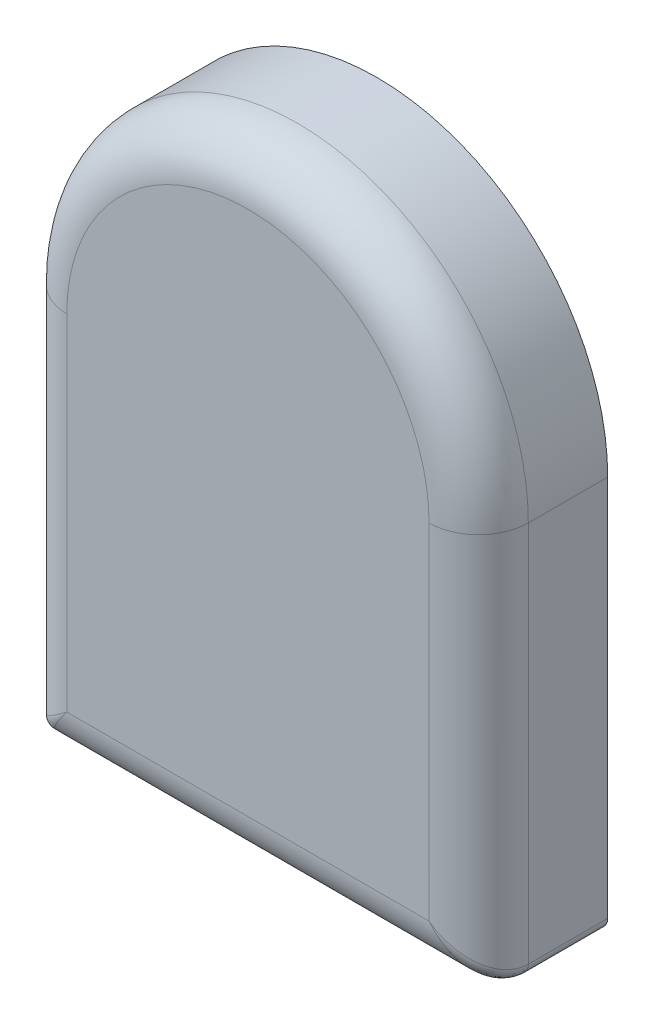
ISO-10303-21;
HEADER;
FILE_DESCRIPTION(('STEP AP214'),'2;1');
FILE_NAME('part.step','',(''),(''),'','','');
FILE_SCHEMA(('AUTOMOTIVE_DESIGN { 1 0 10303 214 1 1 1 1 }'));
ENDSEC;
DATA;
#1=APPLICATION_CONTEXT('core data for automotive mechanical design processes');
#2=APPLICATION_PROTOCOL_DEFINITION('international standard','automotive_design',2000,#1);
#3=PRODUCT_CONTEXT('',#1,'mechanical');
#4=PRODUCT('Part','Part','',(#3));
#5=PRODUCT_RELATED_PRODUCT_CATEGORY('part','',(#4));
#6=PRODUCT_DEFINITION_FORMATION('','',#4);
#7=PRODUCT_DEFINITION_CONTEXT('part definition',#1,'design');
#8=PRODUCT_DEFINITION('design','',#6,#7);
#9=PRODUCT_DEFINITION_SHAPE('','',#8);
#10=(LENGTH_UNIT() NAMED_UNIT(*) SI_UNIT(.MILLI.,.METRE.));
#11=(NAMED_UNIT(*) PLANE_ANGLE_UNIT() SI_UNIT($,.RADIAN.));
#12=(NAMED_UNIT(*) SI_UNIT($,.STERADIAN.) SOLID_ANGLE_UNIT());
#13=UNCERTAINTY_MEASURE_WITH_UNIT(LENGTH_MEASURE(1.E-05),#10,'distance_accuracy_value','');
#14=(GEOMETRIC_REPRESENTATION_CONTEXT(3) GLOBAL_UNCERTAINTY_ASSIGNED_CONTEXT((#13)) GLOBAL_UNIT_ASSIGNED_CONTEXT((#10,
#11,#12)) REPRESENTATION_CONTEXT('',''));
#15=CARTESIAN_POINT('',(0.,0.,0.));
#16=DIRECTION('',(0.,0.,1.));
#17=DIRECTION('',(1.,0.,0.));
#18=AXIS2_PLACEMENT_3D('',#15,#16,#17);
#19=CARTESIAN_POINT('',(8.8,-12.1,5.2));
#20=DIRECTION('',(0.,0.,-1.));
#21=DIRECTION('',(-1.,0.,0.));
#22=AXIS2_PLACEMENT_3D('',#19,#20,#21);
#23=CYLINDRICAL_SURFACE('',#22,0.5);
#24=DIRECTION('',(0.,0.,-1.));
#25=VECTOR('',#24,1.);
#26=CARTESIAN_POINT('',(9.3,-12.1,5.2));
#27=LINE('',#26,#25);
#28=CARTESIAN_POINT('',(9.3,-12.1,3.2));
#29=VERTEX_POINT('',#28);
#30=CARTESIAN_POINT('',(9.3,-12.1,0.));
#31=VERTEX_POINT('',#30);
#32=EDGE_CURVE('E103',#29,#31,#27,.T.);
#33=ORIENTED_EDGE('',*,*,#32,.F.);
#34=CARTESIAN_POINT('',(8.8,-12.1,3.2));
#35=DIRECTION('',(0.,0.,-1.));
#36=DIRECTION('',(-1.,0.,0.));
#37=AXIS2_PLACEMENT_3D('',#34,#35,#36);
#38=CIRCLE('',#37,0.5);
#39=CARTESIAN_POINT('',(8.8,-12.6,3.2));
#40=VERTEX_POINT('',#39);
#41=EDGE_CURVE('E161',#29,#40,#38,.T.);
#42=ORIENTED_EDGE('',*,*,#41,.T.);
#43=DIRECTION('',(0.,0.,-1.));
#44=VECTOR('',#43,1.);
#45=CARTESIAN_POINT('',(8.8,-12.6,5.2));
#46=LINE('',#45,#44);
#47=CARTESIAN_POINT('',(8.8,-12.6,0.));
#48=VERTEX_POINT('',#47);
#49=EDGE_CURVE('E127',#40,#48,#46,.T.);
#50=ORIENTED_EDGE('',*,*,#49,.T.);
#51=CARTESIAN_POINT('',(8.8,-12.1,0.));
#52=DIRECTION('',(0.,0.,1.));
#53=DIRECTION('',(1.,0.,0.));
#54=AXIS2_PLACEMENT_3D('',#51,#52,#53);
#55=CIRCLE('',#54,0.5);
#56=EDGE_CURVE('E121',#48,#31,#55,.T.);
#57=ORIENTED_EDGE('',*,*,#56,.T.);
#58=EDGE_LOOP('',(#33,#42,#50,#57));
#59=FACE_BOUND('',#58,.T.);
#60=ADVANCED_FACE('F38',(#59),#23,.T.);
#61=CARTESIAN_POINT('',(9.3,3.3,5.2));
#62=DIRECTION('',(-1.,0.,0.));
#63=DIRECTION('',(0.,0.,1.));
#64=AXIS2_PLACEMENT_3D('',#61,#62,#63);
#65=PLANE('',#64);
#66=DIRECTION('',(0.,0.,-1.));
#67=VECTOR('',#66,1.);
#68=CARTESIAN_POINT('',(9.3,3.3,5.2));
#69=LINE('',#68,#67);
#70=CARTESIAN_POINT('',(9.3,3.3,3.2));
#71=VERTEX_POINT('',#70);
#72=CARTESIAN_POINT('',(9.3,3.3,0.));
#73=VERTEX_POINT('',#72);
#74=EDGE_CURVE('E115',#71,#73,#69,.T.);
#75=ORIENTED_EDGE('',*,*,#74,.F.);
#76=DIRECTION('',(0.,1.,0.));
#77=VECTOR('',#76,1.);
#78=CARTESIAN_POINT('',(9.3,-12.1,3.2));
#79=LINE('',#78,#77);
#80=EDGE_CURVE('E110',#71,#29,#79,.F.);
#81=ORIENTED_EDGE('',*,*,#80,.T.);
#82=ORIENTED_EDGE('',*,*,#32,.T.);
#83=DIRECTION('',(0.,1.,0.));
#84=VECTOR('',#83,1.);
#85=CARTESIAN_POINT('',(9.3,3.3,0.));
#86=LINE('',#85,#84);
#87=EDGE_CURVE('E107',#31,#73,#86,.T.);
#88=ORIENTED_EDGE('',*,*,#87,.T.);
#89=EDGE_LOOP('',(#75,#81,#82,#88));
#90=FACE_BOUND('',#89,.T.);
#91=ADVANCED_FACE('F106',(#90),#65,.F.);
#92=CARTESIAN_POINT('',(0.,3.3,5.2));
#93=DIRECTION('',(0.,0.,-1.));
#94=DIRECTION('',(-1.,0.,0.));
#95=AXIS2_PLACEMENT_3D('',#92,#93,#94);
#96=CYLINDRICAL_SURFACE('',#95,9.3);
#97=DIRECTION('',(0.,0.,-1.));
#98=VECTOR('',#97,1.);
#99=CARTESIAN_POINT('',(-9.3,3.3,5.2));
#100=LINE('',#99,#98);
#101=CARTESIAN_POINT('',(-9.3,3.3,3.2));
#102=VERTEX_POINT('',#101);
#103=CARTESIAN_POINT('',(-9.3,3.3,0.));
#104=VERTEX_POINT('',#103);
#105=EDGE_CURVE('E147',#102,#104,#100,.T.);
#106=ORIENTED_EDGE('',*,*,#105,.F.);
#107=CARTESIAN_POINT('',(0.,3.3,3.2));
#108=DIRECTION('',(0.,0.,1.));
#109=DIRECTION('',(1.,0.,0.));
#110=AXIS2_PLACEMENT_3D('',#107,#108,#109);
#111=CIRCLE('',#110,9.3);
#112=EDGE_CURVE('E164',#102,#71,#111,.F.);
#113=ORIENTED_EDGE('',*,*,#112,.T.);
#114=ORIENTED_EDGE('',*,*,#74,.T.);
#115=CARTESIAN_POINT('',(0.,3.3,0.));
#116=DIRECTION('',(0.,0.,1.));
#117=DIRECTION('',(1.,0.,0.));
#118=AXIS2_PLACEMENT_3D('',#115,#116,#117);
#119=CIRCLE('',#118,9.3);
#120=EDGE_CURVE('E124',#73,#104,#119,.T.);
#121=ORIENTED_EDGE('',*,*,#120,.T.);
#122=EDGE_LOOP('',(#106,#113,#114,#121));
#123=FACE_BOUND('',#122,.T.);
#124=ADVANCED_FACE('F216',(#123),#96,.T.);
#125=CARTESIAN_POINT('',(-9.3,-12.1,5.2));
#126=DIRECTION('',(1.,0.,0.));
#127=DIRECTION('',(0.,1.,0.));
#128=AXIS2_PLACEMENT_3D('',#125,#126,#127);
#129=PLANE('',#128);
#130=DIRECTION('',(0.,0.,-1.));
#131=VECTOR('',#130,1.);
#132=CARTESIAN_POINT('',(-9.3,-12.1,5.2));
#133=LINE('',#132,#131);
#134=CARTESIAN_POINT('',(-9.3,-12.1,3.2));
#135=VERTEX_POINT('',#134);
#136=CARTESIAN_POINT('',(-9.3,-12.1,0.));
#137=VERTEX_POINT('',#136);
#138=EDGE_CURVE('E145',#135,#137,#133,.T.);
#139=ORIENTED_EDGE('',*,*,#138,.F.);
#140=DIRECTION('',(0.,-1.,0.));
#141=VECTOR('',#140,1.);
#142=CARTESIAN_POINT('',(-9.3,3.3,3.2));
#143=LINE('',#142,#141);
#144=EDGE_CURVE('E47',#135,#102,#143,.F.);
#145=ORIENTED_EDGE('',*,*,#144,.T.);
#146=ORIENTED_EDGE('',*,*,#105,.T.);
#147=DIRECTION('',(0.,-1.,0.));
#148=VECTOR('',#147,1.);
#149=CARTESIAN_POINT('',(-9.3,-12.1,0.));
#150=LINE('',#149,#148);
#151=EDGE_CURVE('E134',#104,#137,#150,.T.);
#152=ORIENTED_EDGE('',*,*,#151,.T.);
#153=EDGE_LOOP('',(#139,#145,#146,#152));
#154=FACE_BOUND('',#153,.T.);
#155=ADVANCED_FACE('F217',(#154),#129,.F.);
#156=CARTESIAN_POINT('',(-8.8,-12.1,5.2));
#157=DIRECTION('',(0.,0.,-1.));
#158=DIRECTION('',(-1.,0.,0.));
#159=AXIS2_PLACEMENT_3D('',#156,#157,#158);
#160=CYLINDRICAL_SURFACE('',#159,0.5);
#161=DIRECTION('',(0.,0.,-1.));
#162=VECTOR('',#161,1.);
#163=CARTESIAN_POINT('',(-8.8,-12.6,5.2));
#164=LINE('',#163,#162);
#165=CARTESIAN_POINT('',(-8.8,-12.6,3.2));
#166=VERTEX_POINT('',#165);
#167=CARTESIAN_POINT('',(-8.8,-12.6,0.));
#168=VERTEX_POINT('',#167);
#169=EDGE_CURVE('E143',#166,#168,#164,.T.);
#170=ORIENTED_EDGE('',*,*,#169,.F.);
#171=CARTESIAN_POINT('',(-8.8,-12.1,3.2));
#172=DIRECTION('',(0.,0.,-1.));
#173=DIRECTION('',(-1.,0.,0.));
#174=AXIS2_PLACEMENT_3D('',#171,#172,#173);
#175=CIRCLE('',#174,0.5);
#176=EDGE_CURVE('E11',#166,#135,#175,.T.);
#177=ORIENTED_EDGE('',*,*,#176,.T.);
#178=ORIENTED_EDGE('',*,*,#138,.T.);
#179=CARTESIAN_POINT('',(-8.8,-12.1,0.));
#180=DIRECTION('',(0.,0.,1.));
#181=DIRECTION('',(1.,0.,0.));
#182=AXIS2_PLACEMENT_3D('',#179,#180,#181);
#183=CIRCLE('',#182,0.5);
#184=EDGE_CURVE('E137',#137,#168,#183,.T.);
#185=ORIENTED_EDGE('',*,*,#184,.T.);
#186=EDGE_LOOP('',(#170,#177,#178,#185));
#187=FACE_BOUND('',#186,.T.);
#188=ADVANCED_FACE('F219',(#187),#160,.T.);
#189=CARTESIAN_POINT('',(8.8,-12.6,5.2));
#190=DIRECTION('',(0.,1.,0.));
#191=DIRECTION('',(0.,0.,1.));
#192=AXIS2_PLACEMENT_3D('',#189,#190,#191);
#193=PLANE('',#192);
#194=ORIENTED_EDGE('',*,*,#49,.F.);
#195=DIRECTION('',(1.,0.,0.));
#196=VECTOR('',#195,1.);
#197=CARTESIAN_POINT('',(-8.8,-12.6,3.2));
#198=LINE('',#197,#196);
#199=EDGE_CURVE('E158',#40,#166,#198,.F.);
#200=ORIENTED_EDGE('',*,*,#199,.T.);
#201=ORIENTED_EDGE('',*,*,#169,.T.);
#202=DIRECTION('',(1.,0.,0.));
#203=VECTOR('',#202,1.);
#204=CARTESIAN_POINT('',(8.8,-12.6,0.));
#205=LINE('',#204,#203);
#206=EDGE_CURVE('E140',#168,#48,#205,.T.);
#207=ORIENTED_EDGE('',*,*,#206,.T.);
#208=EDGE_LOOP('',(#194,#200,#201,#207));
#209=FACE_BOUND('',#208,.T.);
#210=ADVANCED_FACE('F221',(#209),#193,.F.);
#211=CARTESIAN_POINT('',(8.8,-12.1,5.2));
#212=DIRECTION('',(0.,0.,1.));
#213=DIRECTION('',(1.,0.,0.));
#214=AXIS2_PLACEMENT_3D('',#211,#212,#213);
#215=PLANE('',#214);
#216=DIRECTION('',(0.,-1.,0.));
#217=VECTOR('',#216,1.);
#218=CARTESIAN_POINT('',(-7.3,-12.1,5.2));
#219=LINE('',#218,#217);
#220=CARTESIAN_POINT('',(-7.3,3.3,5.2));
#221=VERTEX_POINT('',#220);
#222=CARTESIAN_POINT('',(-7.3,-10.6,5.2));
#223=VERTEX_POINT('',#222);
#224=EDGE_CURVE('E114',#221,#223,#219,.T.);
#225=ORIENTED_EDGE('',*,*,#224,.T.);
#226=DIRECTION('',(1.,0.,0.));
#227=VECTOR('',#226,1.);
#228=CARTESIAN_POINT('',(8.8,-10.6,5.2));
#229=LINE('',#228,#227);
#230=CARTESIAN_POINT('',(7.3,-10.6,5.2));
#231=VERTEX_POINT('',#230);
#232=EDGE_CURVE('E155',#223,#231,#229,.T.);
#233=ORIENTED_EDGE('',*,*,#232,.T.);
#234=DIRECTION('',(0.,1.,0.));
#235=VECTOR('',#234,1.);
#236=CARTESIAN_POINT('',(7.3,3.3,5.2));
#237=LINE('',#236,#235);
#238=CARTESIAN_POINT('',(7.3,3.3,5.2));
#239=VERTEX_POINT('',#238);
#240=EDGE_CURVE('E153',#231,#239,#237,.T.);
#241=ORIENTED_EDGE('',*,*,#240,.T.);
#242=CARTESIAN_POINT('',(0.,3.3,5.2));
#243=DIRECTION('',(0.,0.,1.));
#244=DIRECTION('',(1.,0.,0.));
#245=AXIS2_PLACEMENT_3D('',#242,#243,#244);
#246=CIRCLE('',#245,7.3);
#247=EDGE_CURVE('E151',#239,#221,#246,.T.);
#248=ORIENTED_EDGE('',*,*,#247,.T.);
#249=EDGE_LOOP('',(#225,#233,#241,#248));
#250=FACE_BOUND('',#249,.T.);
#251=ADVANCED_FACE('F227',(#250),#215,.T.);
#252=CARTESIAN_POINT('',(8.8,-12.1,0.));
#253=DIRECTION('',(0.,0.,1.));
#254=DIRECTION('',(1.,0.,0.));
#255=AXIS2_PLACEMENT_3D('',#252,#253,#254);
#256=PLANE('',#255);
#257=ORIENTED_EDGE('',*,*,#56,.F.);
#258=ORIENTED_EDGE('',*,*,#206,.F.);
#259=ORIENTED_EDGE('',*,*,#184,.F.);
#260=ORIENTED_EDGE('',*,*,#151,.F.);
#261=ORIENTED_EDGE('',*,*,#120,.F.);
#262=ORIENTED_EDGE('',*,*,#87,.F.);
#263=EDGE_LOOP('',(#257,#258,#259,#260,#261,#262));
#264=FACE_BOUND('',#263,.T.);
#265=ADVANCED_FACE('F119',(#264),#256,.F.);
#266=CARTESIAN_POINT('',(0.,3.3,3.2));
#267=DIRECTION('',(0.,0.,1.));
#268=DIRECTION('',(1.,0.,0.));
#269=AXIS2_PLACEMENT_3D('',#266,#267,#268);
#270=TOROIDAL_SURFACE('',#269,7.3,2.);
#271=CARTESIAN_POINT('',(7.3,3.3,3.2));
#272=DIRECTION('',(0.,-1.,0.));
#273=DIRECTION('',(0.,0.,-1.));
#274=AXIS2_PLACEMENT_3D('',#271,#272,#273);
#275=CIRCLE('',#274,2.);
#276=EDGE_CURVE('E131',#71,#239,#275,.T.);
#277=ORIENTED_EDGE('',*,*,#276,.F.);
#278=ORIENTED_EDGE('',*,*,#112,.F.);
#279=CARTESIAN_POINT('',(-7.3,3.3,3.2));
#280=DIRECTION('',(0.,-1.,0.));
#281=DIRECTION('',(1.,0.,0.));
#282=AXIS2_PLACEMENT_3D('',#279,#280,#281);
#283=CIRCLE('',#282,2.);
#284=EDGE_CURVE('E42',#221,#102,#283,.T.);
#285=ORIENTED_EDGE('',*,*,#284,.F.);
#286=ORIENTED_EDGE('',*,*,#247,.F.);
#287=EDGE_LOOP('',(#277,#278,#285,#286));
#288=FACE_BOUND('',#287,.T.);
#289=ADVANCED_FACE('F40',(#288),#270,.T.);
#290=CARTESIAN_POINT('',(-7.3,-12.1,3.2));
#291=DIRECTION('',(0.,1.,0.));
#292=DIRECTION('',(-1.,0.,0.));
#293=AXIS2_PLACEMENT_3D('',#290,#291,#292);
#294=CYLINDRICAL_SURFACE('',#293,2.);
#295=ORIENTED_EDGE('',*,*,#284,.T.);
#296=ORIENTED_EDGE('',*,*,#144,.F.);
#297=CARTESIAN_POINT('',(-7.3,-10.6,3.2));
#298=DIRECTION('',(0.6,-0.8,0.));
#299=DIRECTION('',(-0.8,-0.6,0.));
#300=AXIS2_PLACEMENT_3D('',#297,#298,#299);
#301=ELLIPSE('',#300,2.5,2.);
#302=EDGE_CURVE('E174',#223,#135,#301,.T.);
#303=ORIENTED_EDGE('',*,*,#302,.F.);
#304=ORIENTED_EDGE('',*,*,#224,.F.);
#305=EDGE_LOOP('',(#295,#296,#303,#304));
#306=FACE_BOUND('',#305,.T.);
#307=ADVANCED_FACE('F194',(#306),#294,.T.);
#308=CARTESIAN_POINT('',(7.3,-12.1,3.2));
#309=DIRECTION('',(0.,-1.,0.));
#310=DIRECTION('',(0.,0.,-1.));
#311=AXIS2_PLACEMENT_3D('',#308,#309,#310);
#312=CYLINDRICAL_SURFACE('',#311,2.);
#313=ORIENTED_EDGE('',*,*,#276,.T.);
#314=ORIENTED_EDGE('',*,*,#240,.F.);
#315=CARTESIAN_POINT('',(7.3,-10.6,3.2));
#316=DIRECTION('',(0.6,0.8,0.));
#317=DIRECTION('',(0.8,-0.6,0.));
#318=AXIS2_PLACEMENT_3D('',#315,#316,#317);
#319=ELLIPSE('',#318,2.5,2.);
#320=EDGE_CURVE('E171',#29,#231,#319,.F.);
#321=ORIENTED_EDGE('',*,*,#320,.F.);
#322=ORIENTED_EDGE('',*,*,#80,.F.);
#323=EDGE_LOOP('',(#313,#314,#321,#322));
#324=FACE_BOUND('',#323,.T.);
#325=ADVANCED_FACE('F190',(#324),#312,.T.);
#326=CARTESIAN_POINT('',(-7.3,-10.6,1.2));
#327=CARTESIAN_POINT('',(-7.3,-10.6,1.2));
#328=CARTESIAN_POINT('',(-7.3,-10.6,1.2));
#329=CARTESIAN_POINT('',(-7.36534712065569,-10.6871294942076,1.20003505525001));
#330=CARTESIAN_POINT('',(-7.37625301968526,-10.6762530196853,1.1999763390959));
#331=CARTESIAN_POINT('',(-7.38712949420759,-10.6653471206557,1.20003505525001));
#332=CARTESIAN_POINT('',(-7.43071092668624,-10.7742812355817,1.20569648743083));
#333=CARTESIAN_POINT('',(-7.45271669848803,-10.752716698488,1.20427736082193));
#334=CARTESIAN_POINT('',(-7.47428123558166,-10.7307109266862,1.20569648743083));
#335=CARTESIAN_POINT('',(-7.56031449090428,-10.9470859878724,1.2284270510889));
#336=CARTESIAN_POINT('',(-7.60446975212246,-10.9044697521225,1.22140059823371));
#337=CARTESIAN_POINT('',(-7.64708598787237,-10.8603144909043,1.2284270510889));
#338=CARTESIAN_POINT('',(-7.62455908096206,-11.0327454412827,1.24539880932181));
#339=CARTESIAN_POINT('',(-7.68019165762918,-10.9801916576292,1.23424702570518));
#340=CARTESIAN_POINT('',(-7.73274544128274,-10.9245590809621,1.24539880932181));
#341=CARTESIAN_POINT('',(-7.75083012894728,-11.2011068385964,1.29051630855629));
#342=CARTESIAN_POINT('',(-7.82973753195478,-11.1297375319548,1.26847952163033));
#343=CARTESIAN_POINT('',(-7.90110683859638,-11.0508301289473,1.29051630855629));
#344=CARTESIAN_POINT('',(-7.81287571744484,-11.2838342899265,1.31846985415551));
#345=CARTESIAN_POINT('',(-7.90398851452828,-11.2039885145283,1.2899128957497));
#346=CARTESIAN_POINT('',(-7.98383428992645,-11.1128757174448,1.31846985415551));
#347=CARTESIAN_POINT('',(-7.93366820048003,-11.4448909339734,1.38518008569313));
#348=CARTESIAN_POINT('',(-8.04991425185414,-11.3499142518541,1.34136060699245));
#349=CARTESIAN_POINT('',(-8.14489093397337,-11.23366820048,1.38518008569313));
#350=CARTESIAN_POINT('',(-7.99245870376998,-11.5232782716933,1.42365367911435));
#351=CARTESIAN_POINT('',(-8.12200143121126,-11.4220014312113,1.37144196647632));
#352=CARTESIAN_POINT('',(-8.22327827169331,-11.29245870377,1.42365367911435));
#353=CARTESIAN_POINT('',(-8.10570975300993,-11.6742796706799,1.51083477666372));
#354=CARTESIAN_POINT('',(-8.26295325731846,-11.5629532573185,1.44036706240652));
#355=CARTESIAN_POINT('',(-8.3742796706799,-11.4057097530099,1.51083477666372));
#356=CARTESIAN_POINT('',(-8.1602485580067,-11.7469980773423,1.55917755510622));
#357=CARTESIAN_POINT('',(-8.33220337416109,-11.6322033741611,1.4792889175249));
#358=CARTESIAN_POINT('',(-8.44699807734226,-11.4602485580067,1.55917755510622));
#359=CARTESIAN_POINT('',(-8.26402611496821,-11.8853681532909,1.66535303478994));
#360=CARTESIAN_POINT('',(-8.46682192510474,-11.7668219251047,1.56629785668495));
#361=CARTESIAN_POINT('',(-8.58536815329094,-11.5640261149682,1.66535303478995));
#362=CARTESIAN_POINT('',(-8.31338750743845,-11.9511833432513,1.72275539715579));
#363=CARTESIAN_POINT('',(-8.53252990498461,-11.8325299049846,1.61445568037617));
#364=CARTESIAN_POINT('',(-8.65118334325127,-11.6133875074385,1.72275539715579));
#365=CARTESIAN_POINT('',(-8.40591892041319,-12.0745585605509,1.84613222216279));
#366=CARTESIAN_POINT('',(-8.65927843911775,-11.9592784391177,1.72064706325371));
#367=CARTESIAN_POINT('',(-8.77455856055092,-11.7059189204132,1.84613222216279));
#368=CARTESIAN_POINT('',(-8.44926311849199,-12.132350824656,1.91163731328287));
#369=CARTESIAN_POINT('',(-8.72058796060971,-12.0205879606097,1.77870927589382));
#370=CARTESIAN_POINT('',(-8.83235082465598,-11.749263118492,1.91163731328287));
#371=CARTESIAN_POINT('',(-8.52896450999682,-12.2386193466624,2.05013285836795));
#372=CARTESIAN_POINT('',(-8.83742230607737,-12.1374223060774,1.90571865584249));
#373=CARTESIAN_POINT('',(-8.93861934666242,-11.8289645099968,2.05013285836795));
#374=CARTESIAN_POINT('',(-8.56554818620167,-12.2873975816022,2.12265451812362));
#375=CARTESIAN_POINT('',(-8.893119014594,-12.193119014594,1.97459478240419));
#376=CARTESIAN_POINT('',(-8.98739758160223,-11.8655481862017,2.12265451812362));
#377=CARTESIAN_POINT('',(-8.63104897214961,-12.3747319628661,2.27392958631864));
#378=CARTESIAN_POINT('',(-8.99700237456934,-12.2970023745693,2.12428825163707));
#379=CARTESIAN_POINT('',(-9.07473196286614,-11.9310489721496,2.27392958631864));
#380=CARTESIAN_POINT('',(-8.66023331373321,-12.4136444183109,2.35226632370846));
#381=CARTESIAN_POINT('',(-9.04524564728287,-12.3452456472829,2.20485256451251));
#382=CARTESIAN_POINT('',(-9.11364441831094,-11.9602333137332,2.35226632370846));
#383=CARTESIAN_POINT('',(-8.71039789563343,-12.4805305275112,2.51375694675793));
#384=CARTESIAN_POINT('',(-9.13168487740083,-12.4316848774008,2.37835057694996));
#385=CARTESIAN_POINT('',(-9.18053052751125,-12.0103978956334,2.51375694675793));
#386=CARTESIAN_POINT('',(-8.73165591145982,-12.5088745486131,2.59659973042092));
#387=CARTESIAN_POINT('',(-9.16982930810949,-12.4698293081095,2.47075659896622));
#388=CARTESIAN_POINT('',(-9.20887454861309,-12.0316559114598,2.59659973042092));
#389=CARTESIAN_POINT('',(-8.76560412617006,-12.5541388348934,2.76554895244281));
#390=CARTESIAN_POINT('',(-9.23291592445389,-12.5329159244539,2.6666663568643));
#391=CARTESIAN_POINT('',(-9.25413883489341,-12.0656041261701,2.76554895244281));
#392=CARTESIAN_POINT('',(-8.7785324204649,-12.5713765606199,2.85148270452044));
#393=CARTESIAN_POINT('',(-9.25774658379329,-12.5577465837933,2.76930869505542));
#394=CARTESIAN_POINT('',(-9.27137656061987,-12.0785324204649,2.85148270452044));
#395=CARTESIAN_POINT('',(-8.79566049473916,-12.5942139929855,3.02497752445519));
#396=CARTESIAN_POINT('',(-9.29133353940984,-12.5913335394098,2.98185786072974));
#397=CARTESIAN_POINT('',(-9.29421399298555,-12.0956604947392,3.02497752445519));
#398=CARTESIAN_POINT('',(-8.8,-12.6,3.1124887622276));
#399=CARTESIAN_POINT('',(-9.3,-12.6,3.09061065054439));
#400=CARTESIAN_POINT('',(-9.3,-12.1,3.1124887622276));
#401=CARTESIAN_POINT('',(-8.8,-12.6,3.2875112377724));
#402=CARTESIAN_POINT('',(-9.3,-12.6,3.3093893494556));
#403=CARTESIAN_POINT('',(-9.3,-12.1,3.2875112377724));
#404=CARTESIAN_POINT('',(-8.79566049473916,-12.5942139929855,3.37502247554481));
#405=CARTESIAN_POINT('',(-9.29133353940984,-12.5913335394098,3.41814213927026));
#406=CARTESIAN_POINT('',(-9.29421399298555,-12.0956604947392,3.37502247554481));
#407=CARTESIAN_POINT('',(-8.7785324204649,-12.5713765606199,3.54851729547956));
#408=CARTESIAN_POINT('',(-9.25774658379329,-12.5577465837933,3.63069130494458));
#409=CARTESIAN_POINT('',(-9.27137656061987,-12.0785324204649,3.54851729547956));
#410=CARTESIAN_POINT('',(-8.76560412617006,-12.5541388348934,3.63445104755719));
#411=CARTESIAN_POINT('',(-9.23291592445389,-12.5329159244539,3.7333336431357));
#412=CARTESIAN_POINT('',(-9.25413883489341,-12.0656041261701,3.63445104755719));
#413=CARTESIAN_POINT('',(-8.73165591145982,-12.5088745486131,3.80340026957908));
#414=CARTESIAN_POINT('',(-9.16982930810949,-12.4698293081095,3.92924340103378));
#415=CARTESIAN_POINT('',(-9.20887454861309,-12.0316559114598,3.80340026957908));
#416=CARTESIAN_POINT('',(-8.71039789563343,-12.4805305275113,3.88624305324207));
#417=CARTESIAN_POINT('',(-9.13168487740082,-12.4316848774008,4.02164942305004));
#418=CARTESIAN_POINT('',(-9.18053052751125,-12.0103978956334,3.88624305324207));
#419=CARTESIAN_POINT('',(-8.66023331373321,-12.4136444183109,4.04773367629154));
#420=CARTESIAN_POINT('',(-9.04524564728287,-12.3452456472829,4.19514743548749));
#421=CARTESIAN_POINT('',(-9.11364441831094,-11.9602333137332,4.04773367629154));
#422=CARTESIAN_POINT('',(-8.63104897214961,-12.3747319628661,4.12607041368136));
#423=CARTESIAN_POINT('',(-8.99700237456934,-12.2970023745693,4.27571174836293));
#424=CARTESIAN_POINT('',(-9.07473196286614,-11.9310489721496,4.12607041368136));
#425=CARTESIAN_POINT('',(-8.56554818620167,-12.2873975816022,4.27734548187638));
#426=CARTESIAN_POINT('',(-8.893119014594,-12.193119014594,4.42540521759581));
#427=CARTESIAN_POINT('',(-8.98739758160222,-11.8655481862017,4.27734548187638));
#428=CARTESIAN_POINT('',(-8.52896450999682,-12.2386193466624,4.34986714163204));
#429=CARTESIAN_POINT('',(-8.83742230607737,-12.1374223060774,4.49428134415751));
#430=CARTESIAN_POINT('',(-8.93861934666242,-11.8289645099968,4.34986714163204));
#431=CARTESIAN_POINT('',(-8.44926311849199,-12.132350824656,4.48836268671713));
#432=CARTESIAN_POINT('',(-8.72058796060972,-12.0205879606097,4.62129072410618));
#433=CARTESIAN_POINT('',(-8.83235082465598,-11.749263118492,4.48836268671713));
#434=CARTESIAN_POINT('',(-8.40591892041319,-12.0745585605509,4.55386777783721));
#435=CARTESIAN_POINT('',(-8.65927843911775,-11.9592784391177,4.67935293674629));
#436=CARTESIAN_POINT('',(-8.77455856055092,-11.7059189204132,4.55386777783721));
#437=CARTESIAN_POINT('',(-8.31338750743845,-11.9511833432513,4.67724460284421));
#438=CARTESIAN_POINT('',(-8.53252990498461,-11.8325299049846,4.78554431962383));
#439=CARTESIAN_POINT('',(-8.65118334325127,-11.6133875074385,4.67724460284421));
#440=CARTESIAN_POINT('',(-8.26402611496821,-11.8853681532909,4.73464696521005));
#441=CARTESIAN_POINT('',(-8.46682192510474,-11.7668219251047,4.83370214331504));
#442=CARTESIAN_POINT('',(-8.58536815329094,-11.5640261149682,4.73464696521005));
#443=CARTESIAN_POINT('',(-8.1602485580067,-11.7469980773423,4.84082244489378));
#444=CARTESIAN_POINT('',(-8.33220337416109,-11.6322033741611,4.9207110824751));
#445=CARTESIAN_POINT('',(-8.44699807734226,-11.4602485580067,4.84082244489378));
#446=CARTESIAN_POINT('',(-8.10570975300993,-11.6742796706799,4.88916522333628));
#447=CARTESIAN_POINT('',(-8.26295325731846,-11.5629532573185,4.95963293759348));
#448=CARTESIAN_POINT('',(-8.3742796706799,-11.4057097530099,4.88916522333628));
#449=CARTESIAN_POINT('',(-7.99245870376998,-11.5232782716933,4.97634632088565));
#450=CARTESIAN_POINT('',(-8.12200143121126,-11.4220014312113,5.02855803352368));
#451=CARTESIAN_POINT('',(-8.22327827169331,-11.29245870377,4.97634632088565));
#452=CARTESIAN_POINT('',(-7.93366820048003,-11.4448909339734,5.01481991430687));
#453=CARTESIAN_POINT('',(-8.04991425185414,-11.3499142518541,5.05863939300754));
#454=CARTESIAN_POINT('',(-8.14489093397337,-11.23366820048,5.01481991430687));
#455=CARTESIAN_POINT('',(-7.81287571744484,-11.2838342899265,5.08153014584449));
#456=CARTESIAN_POINT('',(-7.90398851452829,-11.2039885145283,5.1100871042503));
#457=CARTESIAN_POINT('',(-7.98383428992646,-11.1128757174448,5.08153014584449));
#458=CARTESIAN_POINT('',(-7.75083012894728,-11.2011068385964,5.10948369144371));
#459=CARTESIAN_POINT('',(-7.82973753195478,-11.1297375319548,5.13152047836967));
#460=CARTESIAN_POINT('',(-7.90110683859638,-11.0508301289473,5.10948369144371));
#461=CARTESIAN_POINT('',(-7.62455908096206,-11.0327454412827,5.15460119067819));
#462=CARTESIAN_POINT('',(-7.68019165762918,-10.9801916576292,5.16575297429482));
#463=CARTESIAN_POINT('',(-7.73274544128274,-10.9245590809621,5.15460119067819));
#464=CARTESIAN_POINT('',(-7.56031449090428,-10.9470859878724,5.1715729489111));
#465=CARTESIAN_POINT('',(-7.60446975212246,-10.9044697521225,5.17859940176629));
#466=CARTESIAN_POINT('',(-7.64708598787237,-10.8603144909043,5.1715729489111));
#467=CARTESIAN_POINT('',(-7.43071092668624,-10.7742812355817,5.19430351256917));
#468=CARTESIAN_POINT('',(-7.45271669848803,-10.752716698488,5.19572263917807));
#469=CARTESIAN_POINT('',(-7.47428123558166,-10.7307109266862,5.19430351256917));
#470=CARTESIAN_POINT('',(-7.3653471206557,-10.6871294942076,5.19996494474999));
#471=CARTESIAN_POINT('',(-7.37625301968526,-10.6762530196853,5.2000236609041));
#472=CARTESIAN_POINT('',(-7.38712949420759,-10.6653471206557,5.19996494474999));
#473=CARTESIAN_POINT('',(-7.3,-10.6,5.2));
#474=CARTESIAN_POINT('',(-7.3,-10.6,5.2));
#475=CARTESIAN_POINT('',(-7.3,-10.6,5.2));
#476=(BOUNDED_SURFACE() B_SPLINE_SURFACE(3,2,((#326,#327,#328),(#329,#330,#331),(#332,#333,
#334),(#335,#336,#337),(#338,#339,#340),(#341,#342,#343),(#344,#345,#346),(#347,#348,#349),
(#350,#351,#352),(#353,#354,#355),(#356,#357,#358),(#359,#360,#361),(#362,#363,#364),(#365,#366,
#367),(#368,#369,#370),(#371,#372,#373),(#374,#375,#376),(#377,#378,#379),(#380,#381,#382),
(#383,#384,#385),(#386,#387,#388),(#389,#390,#391),(#392,#393,#394),(#395,#396,#397),(#398,#399,
#400),(#401,#402,#403),(#404,#405,#406),(#407,#408,#409),(#410,#411,#412),(#413,#414,#415),
(#416,#417,#418),(#419,#420,#421),(#422,#423,#424),(#425,#426,#427),(#428,#429,#430),(#431,#432,
#433),(#434,#435,#436),(#437,#438,#439),(#440,#441,#442),(#443,#444,#445),(#446,#447,#448),
(#449,#450,#451),(#452,#453,#454),(#455,#456,#457),(#458,#459,#460),(#461,#462,#463),(#464,#465,
#466),(#467,#468,#469),(#470,#471,#472),(#473,#474,#475)),.UNSPECIFIED.,.F.,.F.,
.F.) B_SPLINE_SURFACE_WITH_KNOTS((4,2,2,2,2,2,2,2,2,2,2,2,2,2,2,2,2,2,2,2,2,2,2,2,4),(3,3),(0.,
0.277185081205051,0.552014119053092,0.822233461976019,1.08579611517548,1.34096955189626,
1.58644804888033,1.82146864153553,2.04592551633704,2.26046944958155,2.4665662185127,
2.66647462606246,2.86310321556792,3.05973180507339,3.25964021262314,3.46573698155429,
3.6802809147988,3.90473778960032,4.13975838225551,4.38523687923959,4.64041031596037,
4.90397296915983,5.17419231208275,5.44902134993079,5.72620643113585),(0.,1.),
.UNSPECIFIED.) GEOMETRIC_REPRESENTATION_ITEM() RATIONAL_B_SPLINE_SURFACE(((1.,1.,1.),(1.,
1.00000566557019,1.),(1.,0.998576699090688,1.),(1.,0.992910721279765,1.),(1.,0.988697681267574,
1.),(1.,0.97761712883305,1.),(1.,0.970795325018433,1.),(1.,0.954789124900482,1.),(1.,
0.945667069465631,1.),(1.,0.92548796875733,1.),(1.,0.914501756375306,1.),(1.,0.891169998194024,
1.),(1.,0.878891956959708,1.),(1.,0.853706993048538,1.),(1.,0.84084914596985,1.),(1.,
0.815387454422431,1.),(1.,0.802798170091792,1.),(1.,0.778880732263429,1.),(1.,0.767521437046521,
1.),(1.,0.747118526989836,1.),(1.,0.738001346912332,1.),(1.,0.723039691293395,1.),(1.,
0.717105167896984,1.),(1.,0.709170186451793,1.),(1.,0.707106781186548,1.),(1.,0.707106781186548,
1.),(1.,0.709170186451793,1.),(1.,0.717105167896984,1.),(1.,0.723039691293395,1.),(1.,
0.738001346912332,1.),(1.,0.747118526989836,1.),(1.,0.767521437046521,1.),(1.,0.778880732263429,
1.),(1.,0.802798170091792,1.),(1.,0.815387454422431,1.),(1.,0.84084914596985,1.),(1.,
0.853706993048538,1.),(1.,0.878891956959708,1.),(1.,0.891169998194024,1.),(1.,0.914501756375306,
1.),(1.,0.92548796875733,1.),(1.,0.945667069465631,1.),(1.,0.954789124900482,1.),(1.,
0.970795325018433,1.),(1.,0.97761712883305,1.),(1.,0.988697681267574,1.),(1.,0.992910721279765,
1.),(1.,0.998576699090688,1.),(1.,1.00000566557019,1.),(1.,1.,1.))) REPRESENTATION_ITEM('') SURFACE());
#477=ORIENTED_EDGE('',*,*,#302,.T.);
#478=ORIENTED_EDGE('',*,*,#176,.F.);
#479=CARTESIAN_POINT('',(-7.3,-10.6,3.2));
#480=DIRECTION('',(0.8,-0.6,0.));
#481=DIRECTION('',(-0.6,-0.8,0.));
#482=AXIS2_PLACEMENT_3D('',#479,#480,#481);
#483=ELLIPSE('',#482,2.5,2.);
#484=EDGE_CURVE('E169',#223,#166,#483,.T.);
#485=ORIENTED_EDGE('',*,*,#484,.F.);
#486=EDGE_LOOP('',(#477,#478,#485));
#487=FACE_BOUND('',#486,.T.);
#488=ADVANCED_FACE('F186',(#487),#476,.T.);
#489=CARTESIAN_POINT('',(7.3,-10.6,1.2));
#490=CARTESIAN_POINT('',(7.3,-10.6,1.2));
#491=CARTESIAN_POINT('',(7.3,-10.6,1.2));
#492=CARTESIAN_POINT('',(7.38712949420759,-10.6653471206557,1.20003505525001));
#493=CARTESIAN_POINT('',(7.37625301968526,-10.6762530196853,1.1999763390959));
#494=CARTESIAN_POINT('',(7.3653471206557,-10.6871294942076,1.20003505525001));
#495=CARTESIAN_POINT('',(7.47428123558166,-10.7307109266862,1.20569648743083));
#496=CARTESIAN_POINT('',(7.45271669848803,-10.752716698488,1.20427736082193));
#497=CARTESIAN_POINT('',(7.43071092668625,-10.7742812355817,1.20569648743083));
#498=CARTESIAN_POINT('',(7.64708598787237,-10.8603144909043,1.2284270510889));
#499=CARTESIAN_POINT('',(7.60446975212246,-10.9044697521225,1.22140059823371));
#500=CARTESIAN_POINT('',(7.56031449090428,-10.9470859878724,1.2284270510889));
#501=CARTESIAN_POINT('',(7.73274544128274,-10.9245590809621,1.24539880932181));
#502=CARTESIAN_POINT('',(7.68019165762918,-10.9801916576292,1.23424702570518));
#503=CARTESIAN_POINT('',(7.62455908096206,-11.0327454412827,1.24539880932181));
#504=CARTESIAN_POINT('',(7.90110683859638,-11.0508301289473,1.29051630855629));
#505=CARTESIAN_POINT('',(7.82973753195478,-11.1297375319548,1.26847952163033));
#506=CARTESIAN_POINT('',(7.75083012894728,-11.2011068385964,1.29051630855629));
#507=CARTESIAN_POINT('',(7.98383428992646,-11.1128757174448,1.31846985415551));
#508=CARTESIAN_POINT('',(7.90398851452829,-11.2039885145283,1.2899128957497));
#509=CARTESIAN_POINT('',(7.81287571744484,-11.2838342899265,1.31846985415551));
#510=CARTESIAN_POINT('',(8.14489093397337,-11.23366820048,1.38518008569313));
#511=CARTESIAN_POINT('',(8.04991425185414,-11.3499142518541,1.34136060699246));
#512=CARTESIAN_POINT('',(7.93366820048003,-11.4448909339734,1.38518008569313));
#513=CARTESIAN_POINT('',(8.22327827169331,-11.29245870377,1.42365367911435));
#514=CARTESIAN_POINT('',(8.12200143121127,-11.4220014312113,1.37144196647632));
#515=CARTESIAN_POINT('',(7.99245870376998,-11.5232782716933,1.42365367911435));
#516=CARTESIAN_POINT('',(8.3742796706799,-11.4057097530099,1.51083477666372));
#517=CARTESIAN_POINT('',(8.26295325731846,-11.5629532573185,1.44036706240652));
#518=CARTESIAN_POINT('',(8.10570975300993,-11.6742796706799,1.51083477666372));
#519=CARTESIAN_POINT('',(8.44699807734226,-11.4602485580067,1.55917755510622));
#520=CARTESIAN_POINT('',(8.33220337416109,-11.6322033741611,1.4792889175249));
#521=CARTESIAN_POINT('',(8.1602485580067,-11.7469980773423,1.55917755510622));
#522=CARTESIAN_POINT('',(8.58536815329094,-11.5640261149682,1.66535303478994));
#523=CARTESIAN_POINT('',(8.46682192510474,-11.7668219251047,1.56629785668495));
#524=CARTESIAN_POINT('',(8.26402611496821,-11.8853681532909,1.66535303478994));
#525=CARTESIAN_POINT('',(8.65118334325127,-11.6133875074385,1.72275539715579));
#526=CARTESIAN_POINT('',(8.53252990498462,-11.8325299049846,1.61445568037617));
#527=CARTESIAN_POINT('',(8.31338750743845,-11.9511833432513,1.72275539715579));
#528=CARTESIAN_POINT('',(8.77455856055092,-11.7059189204132,1.84613222216279));
#529=CARTESIAN_POINT('',(8.65927843911775,-11.9592784391177,1.72064706325371));
#530=CARTESIAN_POINT('',(8.40591892041319,-12.0745585605509,1.84613222216279));
#531=CARTESIAN_POINT('',(8.83235082465598,-11.749263118492,1.91163731328287));
#532=CARTESIAN_POINT('',(8.72058796060971,-12.0205879606097,1.77870927589382));
#533=CARTESIAN_POINT('',(8.44926311849199,-12.132350824656,1.91163731328287));
#534=CARTESIAN_POINT('',(8.93861934666242,-11.8289645099968,2.05013285836795));
#535=CARTESIAN_POINT('',(8.83742230607737,-12.1374223060774,1.90571865584249));
#536=CARTESIAN_POINT('',(8.52896450999682,-12.2386193466624,2.05013285836795));
#537=CARTESIAN_POINT('',(8.98739758160223,-11.8655481862017,2.12265451812362));
#538=CARTESIAN_POINT('',(8.893119014594,-12.193119014594,1.97459478240419));
#539=CARTESIAN_POINT('',(8.56554818620167,-12.2873975816022,2.12265451812362));
#540=CARTESIAN_POINT('',(9.07473196286614,-11.9310489721496,2.27392958631864));
#541=CARTESIAN_POINT('',(8.99700237456934,-12.2970023745693,2.12428825163707));
#542=CARTESIAN_POINT('',(8.63104897214961,-12.3747319628661,2.27392958631864));
#543=CARTESIAN_POINT('',(9.11364441831095,-11.9602333137332,2.35226632370846));
#544=CARTESIAN_POINT('',(9.04524564728287,-12.3452456472829,2.20485256451251));
#545=CARTESIAN_POINT('',(8.66023331373321,-12.4136444183109,2.35226632370846));
#546=CARTESIAN_POINT('',(9.18053052751125,-12.0103978956334,2.51375694675793));
#547=CARTESIAN_POINT('',(9.13168487740083,-12.4316848774008,2.37835057694996));
#548=CARTESIAN_POINT('',(8.71039789563344,-12.4805305275112,2.51375694675793));
#549=CARTESIAN_POINT('',(9.2088745486131,-12.0316559114598,2.59659973042092));
#550=CARTESIAN_POINT('',(9.16982930810949,-12.4698293081095,2.47075659896622));
#551=CARTESIAN_POINT('',(8.73165591145982,-12.5088745486131,2.59659973042092));
#552=CARTESIAN_POINT('',(9.25413883489341,-12.0656041261701,2.76554895244281));
#553=CARTESIAN_POINT('',(9.23291592445389,-12.5329159244539,2.6666663568643));
#554=CARTESIAN_POINT('',(8.76560412617006,-12.5541388348934,2.76554895244281));
#555=CARTESIAN_POINT('',(9.27137656061987,-12.0785324204649,2.85148270452044));
#556=CARTESIAN_POINT('',(9.25774658379329,-12.5577465837933,2.76930869505542));
#557=CARTESIAN_POINT('',(8.77853242046491,-12.5713765606199,2.85148270452044));
#558=CARTESIAN_POINT('',(9.29421399298555,-12.0956604947392,3.02497752445519));
#559=CARTESIAN_POINT('',(9.29133353940984,-12.5913335394098,2.98185786072974));
#560=CARTESIAN_POINT('',(8.79566049473916,-12.5942139929855,3.02497752445519));
#561=CARTESIAN_POINT('',(9.3,-12.1,3.1124887622276));
#562=CARTESIAN_POINT('',(9.3,-12.6,3.09061065054439));
#563=CARTESIAN_POINT('',(8.8,-12.6,3.1124887622276));
#564=CARTESIAN_POINT('',(9.3,-12.1,3.2875112377724));
#565=CARTESIAN_POINT('',(9.3,-12.6,3.3093893494556));
#566=CARTESIAN_POINT('',(8.8,-12.6,3.2875112377724));
#567=CARTESIAN_POINT('',(9.29421399298555,-12.0956604947392,3.37502247554481));
#568=CARTESIAN_POINT('',(9.29133353940984,-12.5913335394098,3.41814213927026));
#569=CARTESIAN_POINT('',(8.79566049473916,-12.5942139929855,3.37502247554481));
#570=CARTESIAN_POINT('',(9.27137656061987,-12.0785324204649,3.54851729547956));
#571=CARTESIAN_POINT('',(9.25774658379329,-12.5577465837933,3.63069130494458));
#572=CARTESIAN_POINT('',(8.77853242046491,-12.5713765606199,3.54851729547956));
#573=CARTESIAN_POINT('',(9.25413883489341,-12.0656041261701,3.63445104755719));
#574=CARTESIAN_POINT('',(9.23291592445389,-12.5329159244539,3.73333364313569));
#575=CARTESIAN_POINT('',(8.76560412617006,-12.5541388348934,3.63445104755719));
#576=CARTESIAN_POINT('',(9.2088745486131,-12.0316559114598,3.80340026957908));
#577=CARTESIAN_POINT('',(9.1698293081095,-12.4698293081095,3.92924340103378));
#578=CARTESIAN_POINT('',(8.73165591145982,-12.5088745486131,3.80340026957908));
#579=CARTESIAN_POINT('',(9.18053052751125,-12.0103978956334,3.88624305324207));
#580=CARTESIAN_POINT('',(9.13168487740083,-12.4316848774008,4.02164942305004));
#581=CARTESIAN_POINT('',(8.71039789563344,-12.4805305275113,3.88624305324207));
#582=CARTESIAN_POINT('',(9.11364441831095,-11.9602333137332,4.04773367629154));
#583=CARTESIAN_POINT('',(9.04524564728287,-12.3452456472829,4.19514743548749));
#584=CARTESIAN_POINT('',(8.66023331373321,-12.4136444183109,4.04773367629154));
#585=CARTESIAN_POINT('',(9.07473196286614,-11.9310489721496,4.12607041368136));
#586=CARTESIAN_POINT('',(8.99700237456934,-12.2970023745693,4.27571174836293));
#587=CARTESIAN_POINT('',(8.63104897214961,-12.3747319628661,4.12607041368136));
#588=CARTESIAN_POINT('',(8.98739758160223,-11.8655481862017,4.27734548187638));
#589=CARTESIAN_POINT('',(8.893119014594,-12.193119014594,4.42540521759581));
#590=CARTESIAN_POINT('',(8.56554818620167,-12.2873975816022,4.27734548187638));
#591=CARTESIAN_POINT('',(8.93861934666242,-11.8289645099968,4.34986714163204));
#592=CARTESIAN_POINT('',(8.83742230607737,-12.1374223060774,4.49428134415751));
#593=CARTESIAN_POINT('',(8.52896450999682,-12.2386193466624,4.34986714163204));
#594=CARTESIAN_POINT('',(8.83235082465598,-11.749263118492,4.48836268671713));
#595=CARTESIAN_POINT('',(8.72058796060972,-12.0205879606097,4.62129072410618));
#596=CARTESIAN_POINT('',(8.44926311849199,-12.132350824656,4.48836268671713));
#597=CARTESIAN_POINT('',(8.77455856055092,-11.7059189204132,4.55386777783721));
#598=CARTESIAN_POINT('',(8.65927843911775,-11.9592784391177,4.67935293674629));
#599=CARTESIAN_POINT('',(8.40591892041319,-12.0745585605509,4.55386777783721));
#600=CARTESIAN_POINT('',(8.65118334325127,-11.6133875074385,4.67724460284421));
#601=CARTESIAN_POINT('',(8.53252990498462,-11.8325299049846,4.78554431962383));
#602=CARTESIAN_POINT('',(8.31338750743846,-11.9511833432513,4.67724460284421));
#603=CARTESIAN_POINT('',(8.58536815329094,-11.5640261149682,4.73464696521005));
#604=CARTESIAN_POINT('',(8.46682192510474,-11.7668219251047,4.83370214331504));
#605=CARTESIAN_POINT('',(8.26402611496821,-11.8853681532909,4.73464696521005));
#606=CARTESIAN_POINT('',(8.44699807734226,-11.4602485580067,4.84082244489378));
#607=CARTESIAN_POINT('',(8.33220337416109,-11.6322033741611,4.9207110824751));
#608=CARTESIAN_POINT('',(8.1602485580067,-11.7469980773423,4.84082244489378));
#609=CARTESIAN_POINT('',(8.3742796706799,-11.4057097530099,4.88916522333628));
#610=CARTESIAN_POINT('',(8.26295325731846,-11.5629532573185,4.95963293759348));
#611=CARTESIAN_POINT('',(8.10570975300993,-11.6742796706799,4.88916522333628));
#612=CARTESIAN_POINT('',(8.22327827169332,-11.29245870377,4.97634632088565));
#613=CARTESIAN_POINT('',(8.12200143121127,-11.4220014312113,5.02855803352368));
#614=CARTESIAN_POINT('',(7.99245870376999,-11.5232782716933,4.97634632088565));
#615=CARTESIAN_POINT('',(8.14489093397337,-11.23366820048,5.01481991430687));
#616=CARTESIAN_POINT('',(8.04991425185414,-11.3499142518541,5.05863939300755));
#617=CARTESIAN_POINT('',(7.93366820048003,-11.4448909339734,5.01481991430687));
#618=CARTESIAN_POINT('',(7.98383428992646,-11.1128757174448,5.08153014584449));
#619=CARTESIAN_POINT('',(7.90398851452829,-11.2039885145283,5.1100871042503));
#620=CARTESIAN_POINT('',(7.81287571744484,-11.2838342899265,5.08153014584449));
#621=CARTESIAN_POINT('',(7.90110683859638,-11.0508301289473,5.10948369144371));
#622=CARTESIAN_POINT('',(7.82973753195478,-11.1297375319548,5.13152047836967));
#623=CARTESIAN_POINT('',(7.75083012894729,-11.2011068385964,5.10948369144371));
#624=CARTESIAN_POINT('',(7.73274544128274,-10.9245590809621,5.15460119067819));
#625=CARTESIAN_POINT('',(7.68019165762918,-10.9801916576292,5.16575297429482));
#626=CARTESIAN_POINT('',(7.62455908096206,-11.0327454412827,5.15460119067819));
#627=CARTESIAN_POINT('',(7.64708598787237,-10.8603144909043,5.1715729489111));
#628=CARTESIAN_POINT('',(7.60446975212246,-10.9044697521225,5.17859940176629));
#629=CARTESIAN_POINT('',(7.56031449090428,-10.9470859878724,5.1715729489111));
#630=CARTESIAN_POINT('',(7.47428123558166,-10.7307109266862,5.19430351256917));
#631=CARTESIAN_POINT('',(7.45271669848803,-10.752716698488,5.19572263917807));
#632=CARTESIAN_POINT('',(7.43071092668625,-10.7742812355817,5.19430351256917));
#633=CARTESIAN_POINT('',(7.38712949420759,-10.6653471206557,5.19996494474999));
#634=CARTESIAN_POINT('',(7.37625301968526,-10.6762530196853,5.2000236609041));
#635=CARTESIAN_POINT('',(7.3653471206557,-10.6871294942076,5.19996494474999));
#636=CARTESIAN_POINT('',(7.3,-10.6,5.2));
#637=CARTESIAN_POINT('',(7.3,-10.6,5.2));
#638=CARTESIAN_POINT('',(7.3,-10.6,5.2));
#639=(BOUNDED_SURFACE() B_SPLINE_SURFACE(3,2,((#489,#490,#491),(#492,#493,#494),(#495,#496,
#497),(#498,#499,#500),(#501,#502,#503),(#504,#505,#506),(#507,#508,#509),(#510,#511,#512),
(#513,#514,#515),(#516,#517,#518),(#519,#520,#521),(#522,#523,#524),(#525,#526,#527),(#528,#529,
#530),(#531,#532,#533),(#534,#535,#536),(#537,#538,#539),(#540,#541,#542),(#543,#544,#545),
(#546,#547,#548),(#549,#550,#551),(#552,#553,#554),(#555,#556,#557),(#558,#559,#560),(#561,#562,
#563),(#564,#565,#566),(#567,#568,#569),(#570,#571,#572),(#573,#574,#575),(#576,#577,#578),
(#579,#580,#581),(#582,#583,#584),(#585,#586,#587),(#588,#589,#590),(#591,#592,#593),(#594,#595,
#596),(#597,#598,#599),(#600,#601,#602),(#603,#604,#605),(#606,#607,#608),(#609,#610,#611),
(#612,#613,#614),(#615,#616,#617),(#618,#619,#620),(#621,#622,#623),(#624,#625,#626),(#627,#628,
#629),(#630,#631,#632),(#633,#634,#635),(#636,#637,#638)),.UNSPECIFIED.,.F.,.F.,
.F.) B_SPLINE_SURFACE_WITH_KNOTS((4,2,2,2,2,2,2,2,2,2,2,2,2,2,2,2,2,2,2,2,2,2,2,2,4),(3,3),(0.,
0.277185081205051,0.552014119053092,0.822233461976019,1.08579611517548,1.34096955189625,
1.58644804888033,1.82146864153553,2.04592551633704,2.26046944958155,2.4665662185127,
2.66647462606246,2.86310321556792,3.05973180507339,3.25964021262314,3.46573698155429,
3.6802809147988,3.90473778960032,4.13975838225551,4.38523687923959,4.64041031596037,
4.90397296915983,5.17419231208275,5.44902134993079,5.72620643113585),(0.,1.),
.UNSPECIFIED.) GEOMETRIC_REPRESENTATION_ITEM() RATIONAL_B_SPLINE_SURFACE(((1.,1.,1.),(1.,
1.00000566557019,1.),(1.,0.998576699090688,1.),(1.,0.992910721279765,1.),(1.,0.988697681267574,
1.),(1.,0.97761712883305,1.),(1.,0.970795325018433,1.),(1.,0.954789124900482,1.),(1.,
0.945667069465631,1.),(1.,0.92548796875733,1.),(1.,0.914501756375307,1.),(1.,0.891169998194025,
1.),(1.,0.878891956959708,1.),(1.,0.853706993048538,1.),(1.,0.84084914596985,1.),(1.,
0.815387454422431,1.),(1.,0.802798170091792,1.),(1.,0.778880732263429,1.),(1.,0.767521437046521,
1.),(1.,0.747118526989836,1.),(1.,0.738001346912332,1.),(1.,0.723039691293395,1.),(1.,
0.717105167896984,1.),(1.,0.709170186451793,1.),(1.,0.707106781186548,1.),(1.,0.707106781186548,
1.),(1.,0.709170186451793,1.),(1.,0.717105167896984,1.),(1.,0.723039691293394,1.),(1.,
0.738001346912332,1.),(1.,0.747118526989836,1.),(1.,0.767521437046521,1.),(1.,0.778880732263429,
1.),(1.,0.802798170091792,1.),(1.,0.815387454422431,1.),(1.,0.84084914596985,1.),(1.,
0.853706993048538,1.),(1.,0.878891956959708,1.),(1.,0.891169998194024,1.),(1.,0.914501756375306,
1.),(1.,0.92548796875733,1.),(1.,0.945667069465631,1.),(1.,0.954789124900482,1.),(1.,
0.970795325018433,1.),(1.,0.97761712883305,1.),(1.,0.988697681267574,1.),(1.,0.992910721279765,
1.),(1.,0.998576699090688,1.),(1.,1.00000566557019,1.),(1.,1.,1.))) REPRESENTATION_ITEM('') SURFACE());
#640=ORIENTED_EDGE('',*,*,#41,.F.);
#641=ORIENTED_EDGE('',*,*,#320,.T.);
#642=CARTESIAN_POINT('',(7.3,-10.6,3.2));
#643=DIRECTION('',(0.8,0.6,0.));
#644=DIRECTION('',(0.6,-0.8,0.));
#645=AXIS2_PLACEMENT_3D('',#642,#643,#644);
#646=ELLIPSE('',#645,2.5,2.);
#647=EDGE_CURVE('E167',#40,#231,#646,.F.);
#648=ORIENTED_EDGE('',*,*,#647,.F.);
#649=EDGE_LOOP('',(#640,#641,#648));
#650=FACE_BOUND('',#649,.T.);
#651=ADVANCED_FACE('F179',(#650),#639,.T.);
#652=CARTESIAN_POINT('',(8.8,-10.6,3.2));
#653=DIRECTION('',(-1.,0.,0.));
#654=DIRECTION('',(0.,0.,1.));
#655=AXIS2_PLACEMENT_3D('',#652,#653,#654);
#656=CYLINDRICAL_SURFACE('',#655,2.);
#657=ORIENTED_EDGE('',*,*,#484,.T.);
#658=ORIENTED_EDGE('',*,*,#199,.F.);
#659=ORIENTED_EDGE('',*,*,#647,.T.);
#660=ORIENTED_EDGE('',*,*,#232,.F.);
#661=EDGE_LOOP('',(#657,#658,#659,#660));
#662=FACE_BOUND('',#661,.T.);
#663=ADVANCED_FACE('F185',(#662),#656,.T.);
#664=CLOSED_SHELL('',(#60,#91,#124,#155,#188,#210,#251,#265,#289,#307,#325,#488,#651,#663));
#665=MANIFOLD_SOLID_BREP('B2',#664);
#666=ADVANCED_BREP_SHAPE_REPRESENTATION('',(#18,#665),#14);
#667=SHAPE_DEFINITION_REPRESENTATION(#9,#666);
ENDSEC;
END-ISO-10303-21;
